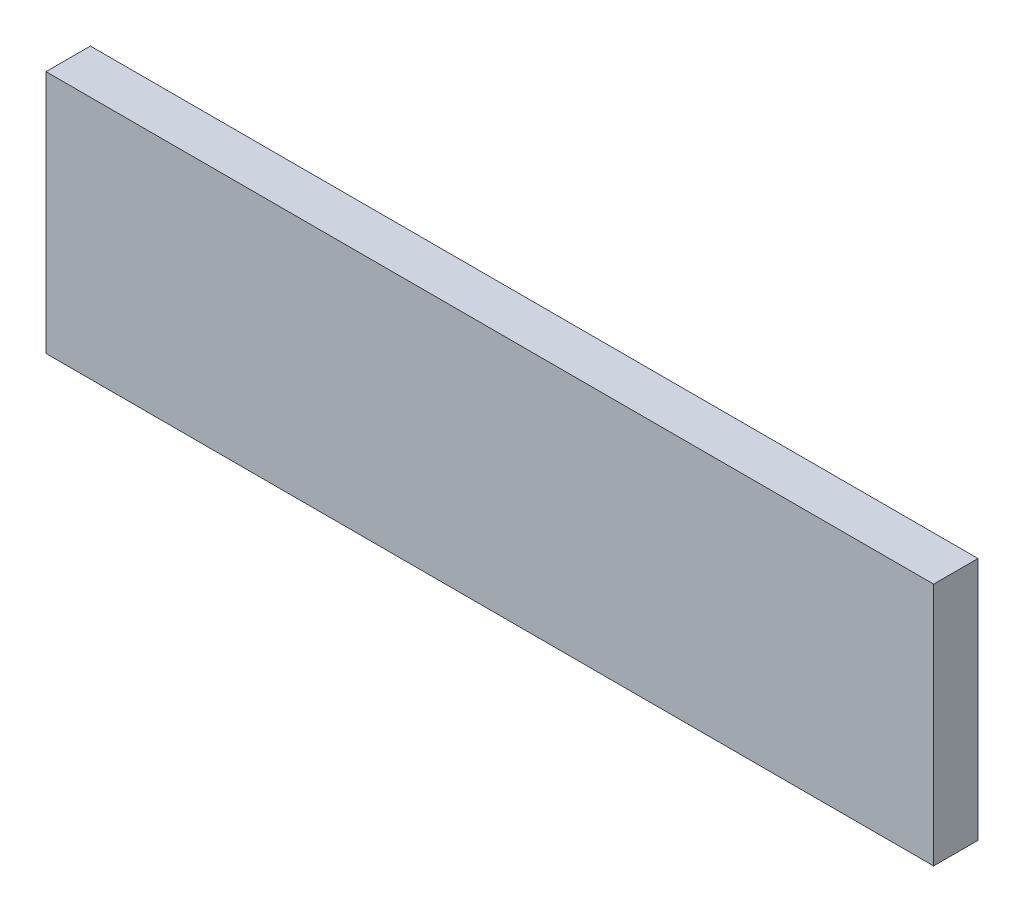
ISO-10303-21;
HEADER;
FILE_DESCRIPTION(('STEP AP214'),'2;1');
FILE_NAME('part.step','',(''),(''),'','','');
FILE_SCHEMA(('AUTOMOTIVE_DESIGN { 1 0 10303 214 1 1 1 1 }'));
ENDSEC;
DATA;
#1=APPLICATION_CONTEXT('core data for automotive mechanical design processes');
#2=APPLICATION_PROTOCOL_DEFINITION('international standard','automotive_design',2000,#1);
#3=PRODUCT_CONTEXT('',#1,'mechanical');
#4=PRODUCT('Part','Part','',(#3));
#5=PRODUCT_RELATED_PRODUCT_CATEGORY('part','',(#4));
#6=PRODUCT_DEFINITION_FORMATION('','',#4);
#7=PRODUCT_DEFINITION_CONTEXT('part definition',#1,'design');
#8=PRODUCT_DEFINITION('design','',#6,#7);
#9=PRODUCT_DEFINITION_SHAPE('','',#8);
#10=(LENGTH_UNIT() NAMED_UNIT(*) SI_UNIT(.MILLI.,.METRE.));
#11=(NAMED_UNIT(*) PLANE_ANGLE_UNIT() SI_UNIT($,.RADIAN.));
#12=(NAMED_UNIT(*) SI_UNIT($,.STERADIAN.) SOLID_ANGLE_UNIT());
#13=UNCERTAINTY_MEASURE_WITH_UNIT(LENGTH_MEASURE(1.E-05),#10,'distance_accuracy_value','');
#14=(GEOMETRIC_REPRESENTATION_CONTEXT(3) GLOBAL_UNCERTAINTY_ASSIGNED_CONTEXT((#13)) GLOBAL_UNIT_ASSIGNED_CONTEXT((#10,
#11,#12)) REPRESENTATION_CONTEXT('',''));
#15=CARTESIAN_POINT('',(0.,0.,0.));
#16=DIRECTION('',(0.,0.,1.));
#17=DIRECTION('',(1.,0.,0.));
#18=AXIS2_PLACEMENT_3D('',#15,#16,#17);
#19=CARTESIAN_POINT('',(0.,0.,100.));
#20=DIRECTION('',(-1.,0.,0.));
#21=DIRECTION('',(0.,-1.,0.));
#22=AXIS2_PLACEMENT_3D('',#19,#20,#21);
#23=PLANE('',#22);
#24=DIRECTION('',(0.,1.,0.));
#25=VECTOR('',#24,1.);
#26=CARTESIAN_POINT('',(0.,0.,0.));
#27=LINE('',#26,#25);
#28=CARTESIAN_POINT('',(0.,-550.,0.));
#29=VERTEX_POINT('',#28);
#30=CARTESIAN_POINT('',(0.,0.,0.));
#31=VERTEX_POINT('',#30);
#32=EDGE_CURVE('E95',#29,#31,#27,.T.);
#33=ORIENTED_EDGE('',*,*,#32,.T.);
#34=DIRECTION('',(0.,0.,-1.));
#35=VECTOR('',#34,1.);
#36=CARTESIAN_POINT('',(0.,0.,100.));
#37=LINE('',#36,#35);
#38=CARTESIAN_POINT('',(0.,0.,100.));
#39=VERTEX_POINT('',#38);
#40=EDGE_CURVE('E11',#39,#31,#37,.T.);
#41=ORIENTED_EDGE('',*,*,#40,.F.);
#42=DIRECTION('',(0.,1.,0.));
#43=VECTOR('',#42,1.);
#44=CARTESIAN_POINT('',(0.,0.,100.));
#45=LINE('',#44,#43);
#46=CARTESIAN_POINT('',(0.,-550.,100.));
#47=VERTEX_POINT('',#46);
#48=EDGE_CURVE('E83',#47,#39,#45,.T.);
#49=ORIENTED_EDGE('',*,*,#48,.F.);
#50=DIRECTION('',(0.,0.,-1.));
#51=VECTOR('',#50,1.);
#52=CARTESIAN_POINT('',(0.,-550.,100.));
#53=LINE('',#52,#51);
#54=EDGE_CURVE('E91',#47,#29,#53,.T.);
#55=ORIENTED_EDGE('',*,*,#54,.T.);
#56=EDGE_LOOP('',(#33,#41,#49,#55));
#57=FACE_BOUND('',#56,.T.);
#58=ADVANCED_FACE('F32',(#57),#23,.F.);
#59=CARTESIAN_POINT('',(0.,0.,100.));
#60=DIRECTION('',(0.,-1.,0.));
#61=DIRECTION('',(1.,0.,0.));
#62=AXIS2_PLACEMENT_3D('',#59,#60,#61);
#63=PLANE('',#62);
#64=DIRECTION('',(-1.,0.,0.));
#65=VECTOR('',#64,1.);
#66=CARTESIAN_POINT('',(0.,0.,0.));
#67=LINE('',#66,#65);
#68=CARTESIAN_POINT('',(-2000.,-2.44929359829471E-13,0.));
#69=VERTEX_POINT('',#68);
#70=EDGE_CURVE('E87',#31,#69,#67,.T.);
#71=ORIENTED_EDGE('',*,*,#70,.T.);
#72=DIRECTION('',(0.,0.,-1.));
#73=VECTOR('',#72,1.);
#74=CARTESIAN_POINT('',(-2000.,-2.44929359829471E-13,100.));
#75=LINE('',#74,#73);
#76=CARTESIAN_POINT('',(-2000.,-2.44929359829471E-13,100.));
#77=VERTEX_POINT('',#76);
#78=EDGE_CURVE('E40',#77,#69,#75,.T.);
#79=ORIENTED_EDGE('',*,*,#78,.F.);
#80=DIRECTION('',(-1.,0.,0.));
#81=VECTOR('',#80,1.);
#82=CARTESIAN_POINT('',(0.,0.,100.));
#83=LINE('',#82,#81);
#84=EDGE_CURVE('E78',#39,#77,#83,.T.);
#85=ORIENTED_EDGE('',*,*,#84,.F.);
#86=ORIENTED_EDGE('',*,*,#40,.T.);
#87=EDGE_LOOP('',(#71,#79,#85,#86));
#88=FACE_BOUND('',#87,.T.);
#89=ADVANCED_FACE('F86',(#88),#63,.F.);
#90=CARTESIAN_POINT('',(-2000.,-2.44929359829471E-13,100.));
#91=DIRECTION('',(1.,0.,0.));
#92=DIRECTION('',(0.,0.,-1.));
#93=AXIS2_PLACEMENT_3D('',#90,#91,#92);
#94=PLANE('',#93);
#95=DIRECTION('',(0.,-1.,0.));
#96=VECTOR('',#95,1.);
#97=CARTESIAN_POINT('',(-2000.,-2.44929359829471E-13,0.));
#98=LINE('',#97,#96);
#99=CARTESIAN_POINT('',(-2000.,-550.,0.));
#100=VERTEX_POINT('',#99);
#101=EDGE_CURVE('E65',#69,#100,#98,.T.);
#102=ORIENTED_EDGE('',*,*,#101,.T.);
#103=DIRECTION('',(0.,0.,-1.));
#104=VECTOR('',#103,1.);
#105=CARTESIAN_POINT('',(-2000.,-550.,100.));
#106=LINE('',#105,#104);
#107=CARTESIAN_POINT('',(-2000.,-550.,100.));
#108=VERTEX_POINT('',#107);
#109=EDGE_CURVE('E88',#108,#100,#106,.T.);
#110=ORIENTED_EDGE('',*,*,#109,.F.);
#111=DIRECTION('',(0.,-1.,0.));
#112=VECTOR('',#111,1.);
#113=CARTESIAN_POINT('',(-2000.,-2.44929359829471E-13,100.));
#114=LINE('',#113,#112);
#115=EDGE_CURVE('E81',#77,#108,#114,.T.);
#116=ORIENTED_EDGE('',*,*,#115,.F.);
#117=ORIENTED_EDGE('',*,*,#78,.T.);
#118=EDGE_LOOP('',(#102,#110,#116,#117));
#119=FACE_BOUND('',#118,.T.);
#120=ADVANCED_FACE('F89',(#119),#94,.F.);
#121=CARTESIAN_POINT('',(0.,-550.,100.));
#122=DIRECTION('',(0.,1.,0.));
#123=DIRECTION('',(-1.,0.,0.));
#124=AXIS2_PLACEMENT_3D('',#121,#122,#123);
#125=PLANE('',#124);
#126=DIRECTION('',(1.,0.,0.));
#127=VECTOR('',#126,1.);
#128=CARTESIAN_POINT('',(0.,-550.,0.));
#129=LINE('',#128,#127);
#130=EDGE_CURVE('E71',#100,#29,#129,.T.);
#131=ORIENTED_EDGE('',*,*,#130,.T.);
#132=ORIENTED_EDGE('',*,*,#54,.F.);
#133=DIRECTION('',(1.,0.,0.));
#134=VECTOR('',#133,1.);
#135=CARTESIAN_POINT('',(0.,-550.,100.));
#136=LINE('',#135,#134);
#137=EDGE_CURVE('E48',#108,#47,#136,.T.);
#138=ORIENTED_EDGE('',*,*,#137,.F.);
#139=ORIENTED_EDGE('',*,*,#109,.T.);
#140=EDGE_LOOP('',(#131,#132,#138,#139));
#141=FACE_BOUND('',#140,.T.);
#142=ADVANCED_FACE('F102',(#141),#125,.F.);
#143=CARTESIAN_POINT('',(0.,0.,100.));
#144=DIRECTION('',(0.,0.,-1.));
#145=DIRECTION('',(-1.,0.,0.));
#146=AXIS2_PLACEMENT_3D('',#143,#144,#145);
#147=PLANE('',#146);
#148=ORIENTED_EDGE('',*,*,#48,.T.);
#149=ORIENTED_EDGE('',*,*,#84,.T.);
#150=ORIENTED_EDGE('',*,*,#115,.T.);
#151=ORIENTED_EDGE('',*,*,#137,.T.);
#152=EDGE_LOOP('',(#148,#149,#150,#151));
#153=FACE_BOUND('',#152,.T.);
#154=ADVANCED_FACE('F79',(#153),#147,.F.);
#155=CARTESIAN_POINT('',(0.,0.,0.));
#156=DIRECTION('',(0.,0.,-1.));
#157=DIRECTION('',(-1.,0.,0.));
#158=AXIS2_PLACEMENT_3D('',#155,#156,#157);
#159=PLANE('',#158);
#160=ORIENTED_EDGE('',*,*,#32,.F.);
#161=ORIENTED_EDGE('',*,*,#130,.F.);
#162=ORIENTED_EDGE('',*,*,#101,.F.);
#163=ORIENTED_EDGE('',*,*,#70,.F.);
#164=EDGE_LOOP('',(#160,#161,#162,#163));
#165=FACE_BOUND('',#164,.T.);
#166=ADVANCED_FACE('F105',(#165),#159,.T.);
#167=CLOSED_SHELL('',(#58,#89,#120,#142,#154,#166));
#168=MANIFOLD_SOLID_BREP('B2',#167);
#169=ADVANCED_BREP_SHAPE_REPRESENTATION('',(#18,#168),#14);
#170=SHAPE_DEFINITION_REPRESENTATION(#9,#169);
ENDSEC;
END-ISO-10303-21;
